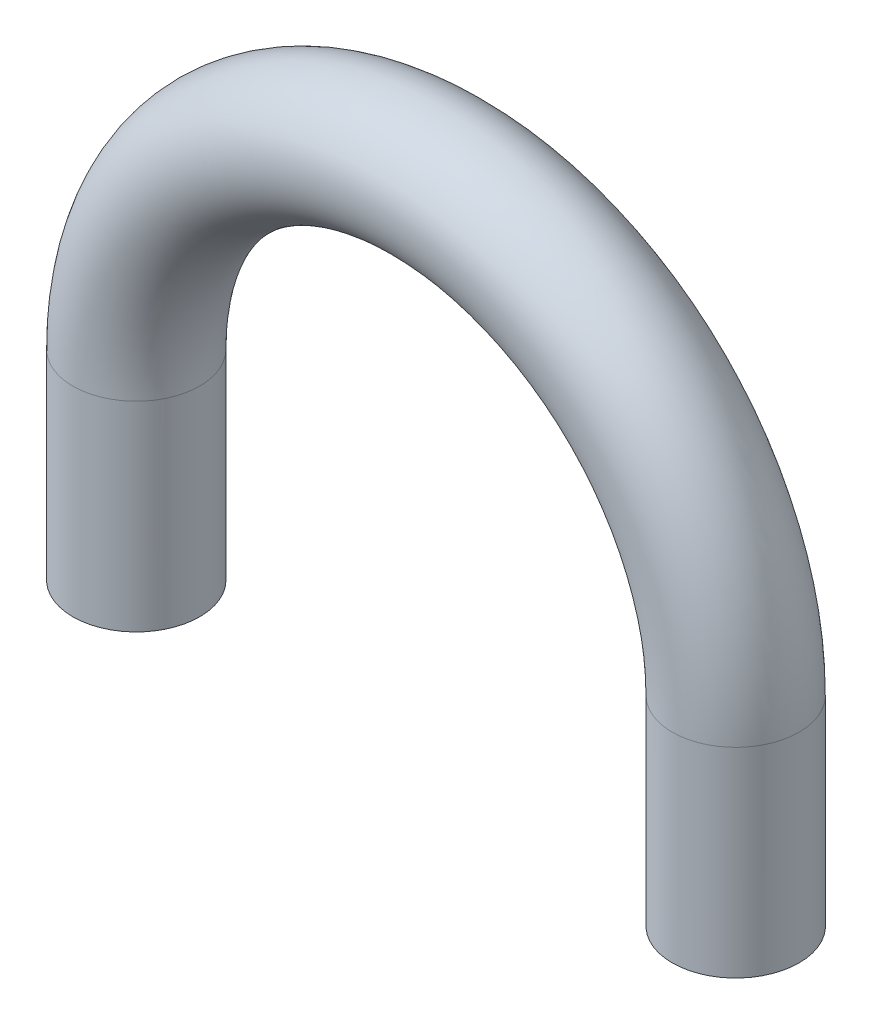
ISO-10303-21;
HEADER;
FILE_DESCRIPTION(('STEP AP214'),'2;1');
FILE_NAME('part.step','',(''),(''),'','','');
FILE_SCHEMA(('AUTOMOTIVE_DESIGN { 1 0 10303 214 1 1 1 1 }'));
ENDSEC;
DATA;
#1=APPLICATION_CONTEXT('core data for automotive mechanical design processes');
#2=APPLICATION_PROTOCOL_DEFINITION('international standard','automotive_design',2000,#1);
#3=PRODUCT_CONTEXT('',#1,'mechanical');
#4=PRODUCT('Part','Part','',(#3));
#5=PRODUCT_RELATED_PRODUCT_CATEGORY('part','',(#4));
#6=PRODUCT_DEFINITION_FORMATION('','',#4);
#7=PRODUCT_DEFINITION_CONTEXT('part definition',#1,'design');
#8=PRODUCT_DEFINITION('design','',#6,#7);
#9=PRODUCT_DEFINITION_SHAPE('','',#8);
#10=(LENGTH_UNIT() NAMED_UNIT(*) SI_UNIT(.MILLI.,.METRE.));
#11=(NAMED_UNIT(*) PLANE_ANGLE_UNIT() SI_UNIT($,.RADIAN.));
#12=(NAMED_UNIT(*) SI_UNIT($,.STERADIAN.) SOLID_ANGLE_UNIT());
#13=UNCERTAINTY_MEASURE_WITH_UNIT(LENGTH_MEASURE(1.E-05),#10,'distance_accuracy_value','');
#14=(GEOMETRIC_REPRESENTATION_CONTEXT(3) GLOBAL_UNCERTAINTY_ASSIGNED_CONTEXT((#13)) GLOBAL_UNIT_ASSIGNED_CONTEXT((#10,
#11,#12)) REPRESENTATION_CONTEXT('',''));
#15=CARTESIAN_POINT('',(0.,0.,0.));
#16=DIRECTION('',(0.,0.,1.));
#17=DIRECTION('',(1.,0.,0.));
#18=AXIS2_PLACEMENT_3D('',#15,#16,#17);
#19=CARTESIAN_POINT('',(-15.,-10.,0.));
#20=DIRECTION('',(0.,-1.,0.));
#21=DIRECTION('',(0.,0.,1.));
#22=AXIS2_PLACEMENT_3D('',#19,#20,#21);
#23=PLANE('',#22);
#24=CARTESIAN_POINT('',(-15.,-10.,0.));
#25=DIRECTION('',(0.,-1.,0.));
#26=DIRECTION('',(0.,0.,1.));
#27=AXIS2_PLACEMENT_3D('',#24,#25,#26);
#28=CIRCLE('',#27,3.175);
#29=CARTESIAN_POINT('',(-15.,-10.,3.175));
#30=VERTEX_POINT('',#29);
#31=EDGE_CURVE('E60',#30,#30,#28,.T.);
#32=ORIENTED_EDGE('',*,*,#31,.T.);
#33=EDGE_LOOP('',(#32));
#34=FACE_BOUND('',#33,.T.);
#35=ADVANCED_FACE('F46',(#34),#23,.T.);
#36=CARTESIAN_POINT('',(15.,-10.,0.));
#37=DIRECTION('',(0.,1.,0.));
#38=DIRECTION('',(0.,0.,1.));
#39=AXIS2_PLACEMENT_3D('',#36,#37,#38);
#40=PLANE('',#39);
#41=CARTESIAN_POINT('',(15.,-10.,0.));
#42=DIRECTION('',(0.,1.,0.));
#43=DIRECTION('',(0.,0.,1.));
#44=AXIS2_PLACEMENT_3D('',#41,#42,#43);
#45=CIRCLE('',#44,3.175);
#46=CARTESIAN_POINT('',(15.,-10.,3.175));
#47=VERTEX_POINT('',#46);
#48=EDGE_CURVE('E11',#47,#47,#45,.T.);
#49=ORIENTED_EDGE('',*,*,#48,.F.);
#50=EDGE_LOOP('',(#49));
#51=FACE_BOUND('',#50,.T.);
#52=ADVANCED_FACE('F70',(#51),#40,.F.);
#53=CARTESIAN_POINT('',(-15.,-10.,0.));
#54=DIRECTION('',(0.,1.,0.));
#55=DIRECTION('',(0.,0.,1.));
#56=AXIS2_PLACEMENT_3D('',#53,#54,#55);
#57=CYLINDRICAL_SURFACE('',#56,3.175);
#58=CARTESIAN_POINT('',(-15.,0.,0.));
#59=DIRECTION('',(0.,-1.,0.));
#60=DIRECTION('',(0.,0.,1.));
#61=AXIS2_PLACEMENT_3D('',#58,#59,#60);
#62=CIRCLE('',#61,3.175);
#63=CARTESIAN_POINT('',(-18.175,0.,0.));
#64=VERTEX_POINT('',#63);
#65=EDGE_CURVE('E56',#64,#64,#62,.T.);
#66=ORIENTED_EDGE('',*,*,#65,.T.);
#67=EDGE_LOOP('',(#66));
#68=FACE_BOUND('',#67,.T.);
#69=ORIENTED_EDGE('',*,*,#31,.F.);
#70=EDGE_LOOP('',(#69));
#71=FACE_BOUND('',#70,.T.);
#72=ADVANCED_FACE('F67',(#68,#71),#57,.T.);
#73=CARTESIAN_POINT('',(0.,0.,0.));
#74=DIRECTION('',(0.,0.,-1.));
#75=DIRECTION('',(-1.,0.,0.));
#76=AXIS2_PLACEMENT_3D('',#73,#74,#75);
#77=TOROIDAL_SURFACE('',#76,15.,3.175);
#78=CARTESIAN_POINT('',(15.,0.,0.));
#79=DIRECTION('',(0.,1.,0.));
#80=DIRECTION('',(0.,0.,1.));
#81=AXIS2_PLACEMENT_3D('',#78,#79,#80);
#82=CIRCLE('',#81,3.175);
#83=CARTESIAN_POINT('',(18.175,0.,0.));
#84=VERTEX_POINT('',#83);
#85=EDGE_CURVE('E52',#84,#84,#82,.T.);
#86=CARTESIAN_POINT('',(0.,0.,0.));
#87=DIRECTION('',(0.,0.,-1.));
#88=DIRECTION('',(-1.,0.,0.));
#89=AXIS2_PLACEMENT_3D('',#86,#87,#88);
#90=CIRCLE('',#89,18.175);
#91=EDGE_CURVE('',#64,#84,#90,.T.);
#92=ORIENTED_EDGE('',*,*,#65,.F.);
#93=ORIENTED_EDGE('',*,*,#85,.T.);
#94=ORIENTED_EDGE('',*,*,#91,.T.);
#95=ORIENTED_EDGE('',*,*,#91,.F.);
#96=EDGE_LOOP('',(#92,#94,#93,#95));
#97=FACE_BOUND('',#96,.T.);
#98=ADVANCED_FACE('F69',(#97),#77,.T.);
#99=CARTESIAN_POINT('',(15.,0.,0.));
#100=DIRECTION('',(0.,-1.,0.));
#101=DIRECTION('',(0.,0.,-1.));
#102=AXIS2_PLACEMENT_3D('',#99,#100,#101);
#103=CYLINDRICAL_SURFACE('',#102,3.175);
#104=ORIENTED_EDGE('',*,*,#48,.T.);
#105=EDGE_LOOP('',(#104));
#106=FACE_BOUND('',#105,.T.);
#107=ORIENTED_EDGE('',*,*,#85,.F.);
#108=EDGE_LOOP('',(#107));
#109=FACE_BOUND('',#108,.T.);
#110=ADVANCED_FACE('F77',(#106,#109),#103,.T.);
#111=CLOSED_SHELL('',(#35,#52,#72,#98,#110));
#112=MANIFOLD_SOLID_BREP('B2',#111);
#113=ADVANCED_BREP_SHAPE_REPRESENTATION('',(#18,#112),#14);
#114=SHAPE_DEFINITION_REPRESENTATION(#9,#113);
ENDSEC;
END-ISO-10303-21;
